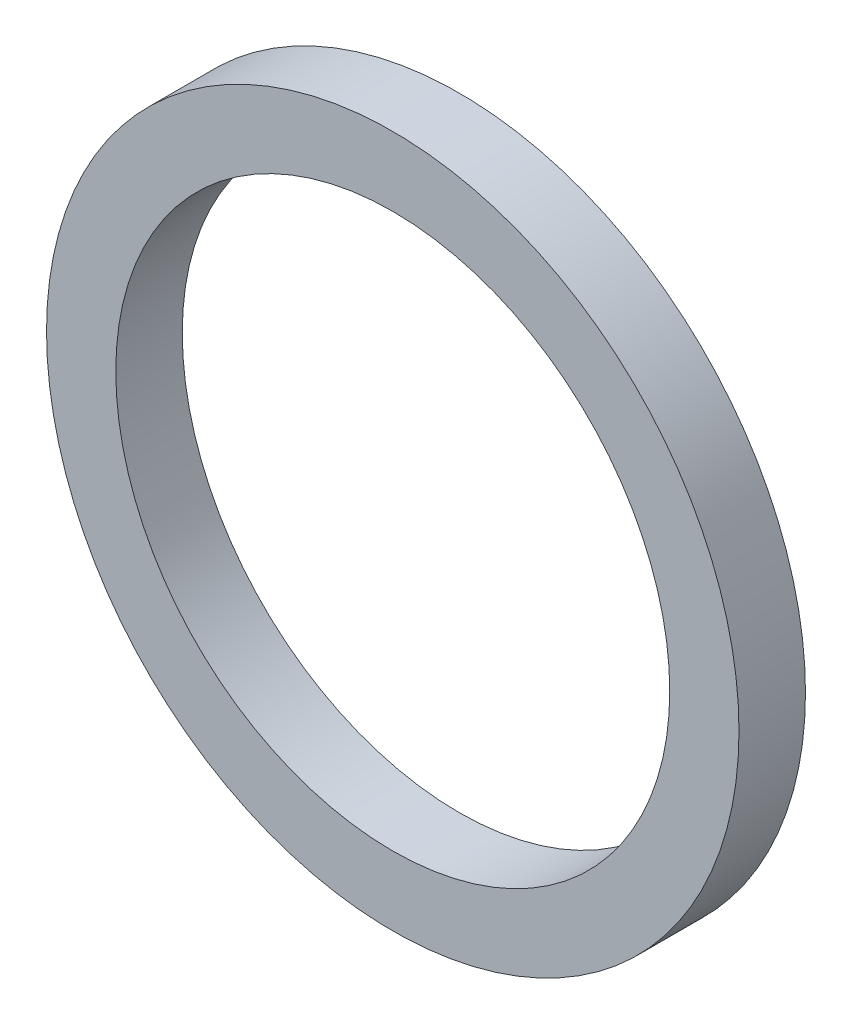
ISO-10303-21;
HEADER;
FILE_DESCRIPTION(('STEP AP214'),'2;1');
FILE_NAME('part.step','',(''),(''),'','','');
FILE_SCHEMA(('AUTOMOTIVE_DESIGN { 1 0 10303 214 1 1 1 1 }'));
ENDSEC;
DATA;
#1=APPLICATION_CONTEXT('core data for automotive mechanical design processes');
#2=APPLICATION_PROTOCOL_DEFINITION('international standard','automotive_design',2000,#1);
#3=PRODUCT_CONTEXT('',#1,'mechanical');
#4=PRODUCT('Part','Part','',(#3));
#5=PRODUCT_RELATED_PRODUCT_CATEGORY('part','',(#4));
#6=PRODUCT_DEFINITION_FORMATION('','',#4);
#7=PRODUCT_DEFINITION_CONTEXT('part definition',#1,'design');
#8=PRODUCT_DEFINITION('design','',#6,#7);
#9=PRODUCT_DEFINITION_SHAPE('','',#8);
#10=(LENGTH_UNIT() NAMED_UNIT(*) SI_UNIT(.MILLI.,.METRE.));
#11=(NAMED_UNIT(*) PLANE_ANGLE_UNIT() SI_UNIT($,.RADIAN.));
#12=(NAMED_UNIT(*) SI_UNIT($,.STERADIAN.) SOLID_ANGLE_UNIT());
#13=UNCERTAINTY_MEASURE_WITH_UNIT(LENGTH_MEASURE(1.E-05),#10,'distance_accuracy_value','');
#14=(GEOMETRIC_REPRESENTATION_CONTEXT(3) GLOBAL_UNCERTAINTY_ASSIGNED_CONTEXT((#13)) GLOBAL_UNIT_ASSIGNED_CONTEXT((#10,
#11,#12)) REPRESENTATION_CONTEXT('',''));
#15=CARTESIAN_POINT('',(0.,0.,0.));
#16=DIRECTION('',(0.,0.,1.));
#17=DIRECTION('',(1.,0.,0.));
#18=AXIS2_PLACEMENT_3D('',#15,#16,#17);
#19=CARTESIAN_POINT('',(0.,0.,0.381));
#20=DIRECTION('',(0.,0.,1.));
#21=DIRECTION('',(1.,0.,0.));
#22=AXIS2_PLACEMENT_3D('',#19,#20,#21);
#23=PLANE('',#22);
#24=CARTESIAN_POINT('',(0.,0.,0.381));
#25=DIRECTION('',(0.,0.,1.));
#26=DIRECTION('',(1.,0.,0.));
#27=AXIS2_PLACEMENT_3D('',#24,#25,#26);
#28=CIRCLE('',#27,3.96875);
#29=CARTESIAN_POINT('',(3.96875,0.,0.381));
#30=VERTEX_POINT('',#29);
#31=EDGE_CURVE('E10',#30,#30,#28,.T.);
#32=ORIENTED_EDGE('',*,*,#31,.T.);
#33=EDGE_LOOP('',(#32));
#34=FACE_BOUND('',#33,.T.);
#35=CARTESIAN_POINT('',(0.,0.,0.381));
#36=DIRECTION('',(0.,0.,1.));
#37=DIRECTION('',(1.,0.,0.));
#38=AXIS2_PLACEMENT_3D('',#35,#36,#37);
#39=CIRCLE('',#38,3.175);
#40=CARTESIAN_POINT('',(3.175,0.,0.381));
#41=VERTEX_POINT('',#40);
#42=EDGE_CURVE('E54',#41,#41,#39,.T.);
#43=ORIENTED_EDGE('',*,*,#42,.F.);
#44=EDGE_LOOP('',(#43));
#45=FACE_BOUND('',#44,.T.);
#46=ADVANCED_FACE('F41',(#34,#45),#23,.T.);
#47=CARTESIAN_POINT('',(0.,0.,-0.381));
#48=DIRECTION('',(0.,0.,1.));
#49=DIRECTION('',(1.,0.,0.));
#50=AXIS2_PLACEMENT_3D('',#47,#48,#49);
#51=PLANE('',#50);
#52=CARTESIAN_POINT('',(0.,0.,-0.381));
#53=DIRECTION('',(0.,0.,1.));
#54=DIRECTION('',(1.,0.,0.));
#55=AXIS2_PLACEMENT_3D('',#52,#53,#54);
#56=CIRCLE('',#55,3.96875);
#57=CARTESIAN_POINT('',(3.96875,0.,-0.381));
#58=VERTEX_POINT('',#57);
#59=EDGE_CURVE('E45',#58,#58,#56,.T.);
#60=ORIENTED_EDGE('',*,*,#59,.F.);
#61=EDGE_LOOP('',(#60));
#62=FACE_BOUND('',#61,.T.);
#63=CARTESIAN_POINT('',(0.,0.,-0.381));
#64=DIRECTION('',(0.,0.,1.));
#65=DIRECTION('',(1.,0.,0.));
#66=AXIS2_PLACEMENT_3D('',#63,#64,#65);
#67=CIRCLE('',#66,3.175);
#68=CARTESIAN_POINT('',(3.175,0.,-0.381));
#69=VERTEX_POINT('',#68);
#70=EDGE_CURVE('E56',#69,#69,#67,.T.);
#71=ORIENTED_EDGE('',*,*,#70,.T.);
#72=EDGE_LOOP('',(#71));
#73=FACE_BOUND('',#72,.T.);
#74=ADVANCED_FACE('F68',(#62,#73),#51,.F.);
#75=CARTESIAN_POINT('',(0.,0.,0.381));
#76=DIRECTION('',(0.,0.,-1.));
#77=DIRECTION('',(-1.,0.,0.));
#78=AXIS2_PLACEMENT_3D('',#75,#76,#77);
#79=CYLINDRICAL_SURFACE('',#78,3.96875);
#80=ORIENTED_EDGE('',*,*,#31,.F.);
#81=EDGE_LOOP('',(#80));
#82=FACE_BOUND('',#81,.T.);
#83=ORIENTED_EDGE('',*,*,#59,.T.);
#84=EDGE_LOOP('',(#83));
#85=FACE_BOUND('',#84,.T.);
#86=ADVANCED_FACE('F43',(#82,#85),#79,.T.);
#87=CARTESIAN_POINT('',(0.,0.,0.381));
#88=DIRECTION('',(0.,0.,-1.));
#89=DIRECTION('',(-1.,0.,0.));
#90=AXIS2_PLACEMENT_3D('',#87,#88,#89);
#91=CYLINDRICAL_SURFACE('',#90,3.175);
#92=ORIENTED_EDGE('',*,*,#42,.T.);
#93=EDGE_LOOP('',(#92));
#94=FACE_BOUND('',#93,.T.);
#95=ORIENTED_EDGE('',*,*,#70,.F.);
#96=EDGE_LOOP('',(#95));
#97=FACE_BOUND('',#96,.T.);
#98=ADVANCED_FACE('F64',(#94,#97),#91,.F.);
#99=CLOSED_SHELL('',(#46,#74,#86,#98));
#100=MANIFOLD_SOLID_BREP('B2',#99);
#101=ADVANCED_BREP_SHAPE_REPRESENTATION('',(#18,#100),#14);
#102=SHAPE_DEFINITION_REPRESENTATION(#9,#101);
ENDSEC;
END-ISO-10303-21;
